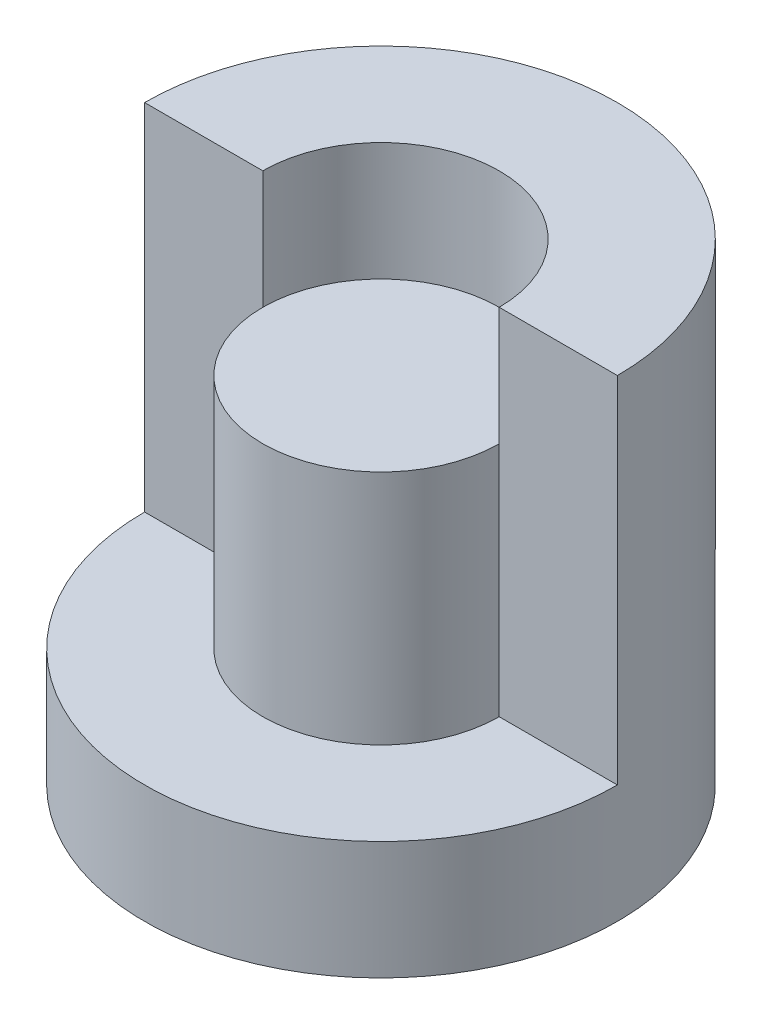
ISO-10303-21;
HEADER;
FILE_DESCRIPTION(('STEP AP214'),'2;1');
FILE_NAME('part.step','',(''),(''),'','','');
FILE_SCHEMA(('AUTOMOTIVE_DESIGN { 1 0 10303 214 1 1 1 1 }'));
ENDSEC;
DATA;
#1=APPLICATION_CONTEXT('core data for automotive mechanical design processes');
#2=APPLICATION_PROTOCOL_DEFINITION('international standard','automotive_design',2000,#1);
#3=PRODUCT_CONTEXT('',#1,'mechanical');
#4=PRODUCT('Part','Part','',(#3));
#5=PRODUCT_RELATED_PRODUCT_CATEGORY('part','',(#4));
#6=PRODUCT_DEFINITION_FORMATION('','',#4);
#7=PRODUCT_DEFINITION_CONTEXT('part definition',#1,'design');
#8=PRODUCT_DEFINITION('design','',#6,#7);
#9=PRODUCT_DEFINITION_SHAPE('','',#8);
#10=(LENGTH_UNIT() NAMED_UNIT(*) SI_UNIT(.MILLI.,.METRE.));
#11=(NAMED_UNIT(*) PLANE_ANGLE_UNIT() SI_UNIT($,.RADIAN.));
#12=(NAMED_UNIT(*) SI_UNIT($,.STERADIAN.) SOLID_ANGLE_UNIT());
#13=UNCERTAINTY_MEASURE_WITH_UNIT(LENGTH_MEASURE(1.E-05),#10,'distance_accuracy_value','');
#14=(GEOMETRIC_REPRESENTATION_CONTEXT(3) GLOBAL_UNCERTAINTY_ASSIGNED_CONTEXT((#13)) GLOBAL_UNIT_ASSIGNED_CONTEXT((#10,
#11,#12)) REPRESENTATION_CONTEXT('',''));
#15=CARTESIAN_POINT('',(0.,0.,0.));
#16=DIRECTION('',(0.,0.,1.));
#17=DIRECTION('',(1.,0.,0.));
#18=AXIS2_PLACEMENT_3D('',#15,#16,#17);
#19=CARTESIAN_POINT('',(0.,20.,0.));
#20=DIRECTION('',(0.,1.,0.));
#21=DIRECTION('',(0.,0.,1.));
#22=AXIS2_PLACEMENT_3D('',#19,#20,#21);
#23=PLANE('',#22);
#24=DIRECTION('',(-1.,0.,0.));
#25=VECTOR('',#24,1.);
#26=CARTESIAN_POINT('',(-10.,20.,0.));
#27=LINE('',#26,#25);
#28=CARTESIAN_POINT('',(-5.,20.,0.));
#29=VERTEX_POINT('',#28);
#30=CARTESIAN_POINT('',(-10.,20.,0.));
#31=VERTEX_POINT('',#30);
#32=EDGE_CURVE('E95',#29,#31,#27,.T.);
#33=ORIENTED_EDGE('',*,*,#32,.F.);
#34=CARTESIAN_POINT('',(0.,20.,0.));
#35=DIRECTION('',(0.,1.,0.));
#36=DIRECTION('',(0.,0.,1.));
#37=AXIS2_PLACEMENT_3D('',#34,#35,#36);
#38=CIRCLE('',#37,5.);
#39=CARTESIAN_POINT('',(5.,20.,0.));
#40=VERTEX_POINT('',#39);
#41=EDGE_CURVE('E110',#40,#29,#38,.T.);
#42=ORIENTED_EDGE('',*,*,#41,.F.);
#43=DIRECTION('',(-1.,0.,0.));
#44=VECTOR('',#43,1.);
#45=CARTESIAN_POINT('',(5.,20.,0.));
#46=LINE('',#45,#44);
#47=CARTESIAN_POINT('',(10.,20.,0.));
#48=VERTEX_POINT('',#47);
#49=EDGE_CURVE('E199',#48,#40,#46,.T.);
#50=ORIENTED_EDGE('',*,*,#49,.F.);
#51=CARTESIAN_POINT('',(0.,20.,0.));
#52=DIRECTION('',(0.,-1.,0.));
#53=DIRECTION('',(0.,0.,-1.));
#54=AXIS2_PLACEMENT_3D('',#51,#52,#53);
#55=CIRCLE('',#54,10.);
#56=EDGE_CURVE('E11',#31,#48,#55,.T.);
#57=ORIENTED_EDGE('',*,*,#56,.F.);
#58=EDGE_LOOP('',(#33,#42,#50,#57));
#59=FACE_BOUND('',#58,.T.);
#60=ADVANCED_FACE('F33',(#59),#23,.T.);
#61=CARTESIAN_POINT('',(0.,0.,0.));
#62=DIRECTION('',(0.,-1.,0.));
#63=DIRECTION('',(0.,0.,-1.));
#64=AXIS2_PLACEMENT_3D('',#61,#62,#63);
#65=CYLINDRICAL_SURFACE('',#64,10.);
#66=DIRECTION('',(0.,1.,0.));
#67=VECTOR('',#66,1.);
#68=CARTESIAN_POINT('',(-10.,5.,0.));
#69=LINE('',#68,#67);
#70=CARTESIAN_POINT('',(-10.,5.,0.));
#71=VERTEX_POINT('',#70);
#72=EDGE_CURVE('E112',#71,#31,#69,.T.);
#73=ORIENTED_EDGE('',*,*,#72,.T.);
#74=ORIENTED_EDGE('',*,*,#56,.T.);
#75=DIRECTION('',(0.,1.,0.));
#76=VECTOR('',#75,1.);
#77=CARTESIAN_POINT('',(10.,5.,0.));
#78=LINE('',#77,#76);
#79=CARTESIAN_POINT('',(10.,5.,0.));
#80=VERTEX_POINT('',#79);
#81=EDGE_CURVE('E81',#80,#48,#78,.T.);
#82=ORIENTED_EDGE('',*,*,#81,.F.);
#83=CARTESIAN_POINT('',(0.,5.,0.));
#84=DIRECTION('',(0.,1.,0.));
#85=DIRECTION('',(0.,0.,1.));
#86=AXIS2_PLACEMENT_3D('',#83,#84,#85);
#87=CIRCLE('',#86,10.);
#88=EDGE_CURVE('E86',#71,#80,#87,.T.);
#89=ORIENTED_EDGE('',*,*,#88,.F.);
#90=EDGE_LOOP('',(#73,#74,#82,#89));
#91=FACE_BOUND('',#90,.T.);
#92=CARTESIAN_POINT('',(0.,0.,0.));
#93=DIRECTION('',(0.,-1.,0.));
#94=DIRECTION('',(0.,0.,-1.));
#95=AXIS2_PLACEMENT_3D('',#92,#93,#94);
#96=CIRCLE('',#95,10.);
#97=CARTESIAN_POINT('',(0.,0.,-10.));
#98=VERTEX_POINT('',#97);
#99=EDGE_CURVE('E40',#98,#98,#96,.T.);
#100=ORIENTED_EDGE('',*,*,#99,.F.);
#101=EDGE_LOOP('',(#100));
#102=FACE_BOUND('',#101,.T.);
#103=ADVANCED_FACE('F97',(#91,#102),#65,.T.);
#104=CARTESIAN_POINT('',(0.,0.,0.));
#105=DIRECTION('',(0.,-1.,0.));
#106=DIRECTION('',(0.,0.,-1.));
#107=AXIS2_PLACEMENT_3D('',#104,#105,#106);
#108=PLANE('',#107);
#109=ORIENTED_EDGE('',*,*,#99,.T.);
#110=EDGE_LOOP('',(#109));
#111=FACE_BOUND('',#110,.T.);
#112=ADVANCED_FACE('F116',(#111),#108,.T.);
#113=CARTESIAN_POINT('',(0.,15.,0.));
#114=DIRECTION('',(0.,1.,0.));
#115=DIRECTION('',(0.,0.,1.));
#116=AXIS2_PLACEMENT_3D('',#113,#114,#115);
#117=CYLINDRICAL_SURFACE('',#116,5.);
#118=ORIENTED_EDGE('',*,*,#41,.T.);
#119=DIRECTION('',(0.,1.,0.));
#120=VECTOR('',#119,1.);
#121=CARTESIAN_POINT('',(-5.,5.,0.));
#122=LINE('',#121,#120);
#123=CARTESIAN_POINT('',(-5.,15.,0.));
#124=VERTEX_POINT('',#123);
#125=EDGE_CURVE('E197',#124,#29,#122,.T.);
#126=ORIENTED_EDGE('',*,*,#125,.F.);
#127=CARTESIAN_POINT('',(0.,15.,0.));
#128=DIRECTION('',(0.,1.,0.));
#129=DIRECTION('',(0.,0.,1.));
#130=AXIS2_PLACEMENT_3D('',#127,#128,#129);
#131=CIRCLE('',#130,5.);
#132=CARTESIAN_POINT('',(5.,15.,0.));
#133=VERTEX_POINT('',#132);
#134=EDGE_CURVE('E107',#133,#124,#131,.T.);
#135=ORIENTED_EDGE('',*,*,#134,.F.);
#136=DIRECTION('',(0.,1.,0.));
#137=VECTOR('',#136,1.);
#138=CARTESIAN_POINT('',(5.,5.,0.));
#139=LINE('',#138,#137);
#140=EDGE_CURVE('E100',#133,#40,#139,.T.);
#141=ORIENTED_EDGE('',*,*,#140,.T.);
#142=EDGE_LOOP('',(#118,#126,#135,#141));
#143=FACE_BOUND('',#142,.T.);
#144=ADVANCED_FACE('F122',(#143),#117,.F.);
#145=CARTESIAN_POINT('',(0.,15.,0.));
#146=DIRECTION('',(0.,1.,0.));
#147=DIRECTION('',(0.,0.,1.));
#148=AXIS2_PLACEMENT_3D('',#145,#146,#147);
#149=PLANE('',#148);
#150=ORIENTED_EDGE('',*,*,#134,.T.);
#151=EDGE_CURVE('E52',#124,#133,#131,.T.);
#152=ORIENTED_EDGE('',*,*,#151,.T.);
#153=EDGE_LOOP('',(#150,#152));
#154=FACE_BOUND('',#153,.T.);
#155=ADVANCED_FACE('F128',(#154),#149,.T.);
#156=CARTESIAN_POINT('',(-10.,5.,0.));
#157=DIRECTION('',(0.,0.,-1.));
#158=DIRECTION('',(-1.,0.,0.));
#159=AXIS2_PLACEMENT_3D('',#156,#157,#158);
#160=PLANE('',#159);
#161=ORIENTED_EDGE('',*,*,#32,.T.);
#162=ORIENTED_EDGE('',*,*,#72,.F.);
#163=DIRECTION('',(-1.,0.,0.));
#164=VECTOR('',#163,1.);
#165=CARTESIAN_POINT('',(-10.,5.,0.));
#166=LINE('',#165,#164);
#167=CARTESIAN_POINT('',(-5.,5.,0.));
#168=VERTEX_POINT('',#167);
#169=EDGE_CURVE('E92',#168,#71,#166,.T.);
#170=ORIENTED_EDGE('',*,*,#169,.F.);
#171=EDGE_CURVE('E201',#168,#124,#122,.T.);
#172=ORIENTED_EDGE('',*,*,#171,.T.);
#173=ORIENTED_EDGE('',*,*,#125,.T.);
#174=EDGE_LOOP('',(#161,#162,#170,#172,#173));
#175=FACE_BOUND('',#174,.T.);
#176=ADVANCED_FACE('F132',(#175),#160,.F.);
#177=CARTESIAN_POINT('',(0.,5.,0.));
#178=DIRECTION('',(0.,1.,0.));
#179=DIRECTION('',(0.,0.,1.));
#180=AXIS2_PLACEMENT_3D('',#177,#178,#179);
#181=CYLINDRICAL_SURFACE('',#180,5.);
#182=ORIENTED_EDGE('',*,*,#151,.F.);
#183=ORIENTED_EDGE('',*,*,#171,.F.);
#184=CARTESIAN_POINT('',(0.,5.,0.));
#185=DIRECTION('',(0.,-1.,0.));
#186=DIRECTION('',(0.,0.,1.));
#187=AXIS2_PLACEMENT_3D('',#184,#185,#186);
#188=CIRCLE('',#187,5.);
#189=CARTESIAN_POINT('',(5.,5.,0.));
#190=VERTEX_POINT('',#189);
#191=EDGE_CURVE('E85',#190,#168,#188,.T.);
#192=ORIENTED_EDGE('',*,*,#191,.F.);
#193=EDGE_CURVE('E47',#190,#133,#139,.T.);
#194=ORIENTED_EDGE('',*,*,#193,.T.);
#195=EDGE_LOOP('',(#182,#183,#192,#194));
#196=FACE_BOUND('',#195,.T.);
#197=ADVANCED_FACE('F136',(#196),#181,.T.);
#198=CARTESIAN_POINT('',(5.,5.,0.));
#199=DIRECTION('',(0.,0.,-1.));
#200=DIRECTION('',(-1.,0.,0.));
#201=AXIS2_PLACEMENT_3D('',#198,#199,#200);
#202=PLANE('',#201);
#203=ORIENTED_EDGE('',*,*,#49,.T.);
#204=ORIENTED_EDGE('',*,*,#140,.F.);
#205=ORIENTED_EDGE('',*,*,#193,.F.);
#206=DIRECTION('',(-1.,0.,0.));
#207=VECTOR('',#206,1.);
#208=CARTESIAN_POINT('',(5.,5.,0.));
#209=LINE('',#208,#207);
#210=EDGE_CURVE('E77',#80,#190,#209,.T.);
#211=ORIENTED_EDGE('',*,*,#210,.F.);
#212=ORIENTED_EDGE('',*,*,#81,.T.);
#213=EDGE_LOOP('',(#203,#204,#205,#211,#212));
#214=FACE_BOUND('',#213,.T.);
#215=ADVANCED_FACE('F79',(#214),#202,.F.);
#216=CARTESIAN_POINT('',(0.,5.,0.));
#217=DIRECTION('',(0.,1.,0.));
#218=DIRECTION('',(0.,0.,1.));
#219=AXIS2_PLACEMENT_3D('',#216,#217,#218);
#220=PLANE('',#219);
#221=ORIENTED_EDGE('',*,*,#88,.T.);
#222=ORIENTED_EDGE('',*,*,#210,.T.);
#223=ORIENTED_EDGE('',*,*,#191,.T.);
#224=ORIENTED_EDGE('',*,*,#169,.T.);
#225=EDGE_LOOP('',(#221,#222,#223,#224));
#226=FACE_BOUND('',#225,.T.);
#227=ADVANCED_FACE('F90',(#226),#220,.T.);
#228=CLOSED_SHELL('',(#60,#103,#112,#144,#155,#176,#197,#215,#227));
#229=MANIFOLD_SOLID_BREP('B2',#228);
#230=ADVANCED_BREP_SHAPE_REPRESENTATION('',(#18,#229),#14);
#231=SHAPE_DEFINITION_REPRESENTATION(#9,#230);
ENDSEC;
END-ISO-10303-21;
